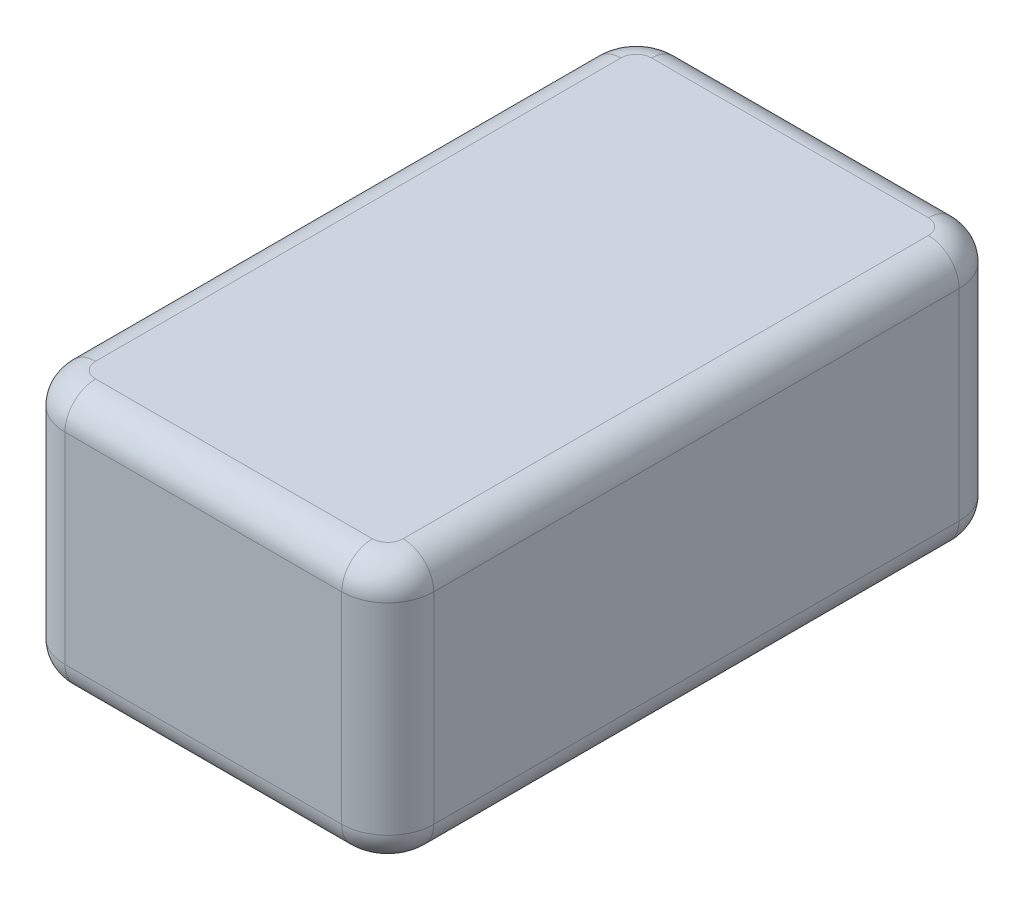
ISO-10303-21;
HEADER;
FILE_DESCRIPTION(('STEP AP214'),'2;1');
FILE_NAME('part.step','',(''),(''),'','','');
FILE_SCHEMA(('AUTOMOTIVE_DESIGN { 1 0 10303 214 1 1 1 1 }'));
ENDSEC;
DATA;
#1=APPLICATION_CONTEXT('core data for automotive mechanical design processes');
#2=APPLICATION_PROTOCOL_DEFINITION('international standard','automotive_design',2000,#1);
#3=PRODUCT_CONTEXT('',#1,'mechanical');
#4=PRODUCT('Part','Part','',(#3));
#5=PRODUCT_RELATED_PRODUCT_CATEGORY('part','',(#4));
#6=PRODUCT_DEFINITION_FORMATION('','',#4);
#7=PRODUCT_DEFINITION_CONTEXT('part definition',#1,'design');
#8=PRODUCT_DEFINITION('design','',#6,#7);
#9=PRODUCT_DEFINITION_SHAPE('','',#8);
#10=(LENGTH_UNIT() NAMED_UNIT(*) SI_UNIT(.MILLI.,.METRE.));
#11=(NAMED_UNIT(*) PLANE_ANGLE_UNIT() SI_UNIT($,.RADIAN.));
#12=(NAMED_UNIT(*) SI_UNIT($,.STERADIAN.) SOLID_ANGLE_UNIT());
#13=UNCERTAINTY_MEASURE_WITH_UNIT(LENGTH_MEASURE(1.E-05),#10,'distance_accuracy_value','');
#14=(GEOMETRIC_REPRESENTATION_CONTEXT(3) GLOBAL_UNCERTAINTY_ASSIGNED_CONTEXT((#13)) GLOBAL_UNIT_ASSIGNED_CONTEXT((#10,
#11,#12)) REPRESENTATION_CONTEXT('',''));
#15=CARTESIAN_POINT('',(0.,0.,0.));
#16=DIRECTION('',(0.,0.,1.));
#17=DIRECTION('',(1.,0.,0.));
#18=AXIS2_PLACEMENT_3D('',#15,#16,#17);
#19=CARTESIAN_POINT('',(0.,217.424,0.));
#20=DIRECTION('',(1.,0.,0.));
#21=DIRECTION('',(0.,0.,-1.));
#22=AXIS2_PLACEMENT_3D('',#19,#20,#21);
#23=PLANE('',#22);
#24=DIRECTION('',(0.,-1.,0.));
#25=VECTOR('',#24,1.);
#26=CARTESIAN_POINT('',(0.,217.424,-472.948));
#27=LINE('',#26,#25);
#28=CARTESIAN_POINT('',(0.,192.024,-472.948));
#29=VERTEX_POINT('',#28);
#30=CARTESIAN_POINT('',(0.,25.4,-472.948));
#31=VERTEX_POINT('',#30);
#32=EDGE_CURVE('E297',#29,#31,#27,.T.);
#33=ORIENTED_EDGE('',*,*,#32,.T.);
#34=DIRECTION('',(0.,0.,1.));
#35=VECTOR('',#34,1.);
#36=CARTESIAN_POINT('',(0.,25.4,-38.1));
#37=LINE('',#36,#35);
#38=CARTESIAN_POINT('',(0.,25.4,-38.1));
#39=VERTEX_POINT('',#38);
#40=EDGE_CURVE('E218',#31,#39,#37,.T.);
#41=ORIENTED_EDGE('',*,*,#40,.T.);
#42=DIRECTION('',(0.,-1.,0.));
#43=VECTOR('',#42,1.);
#44=CARTESIAN_POINT('',(0.,217.424,-38.1));
#45=LINE('',#44,#43);
#46=CARTESIAN_POINT('',(0.,192.024,-38.1));
#47=VERTEX_POINT('',#46);
#48=EDGE_CURVE('E290',#39,#47,#45,.F.);
#49=ORIENTED_EDGE('',*,*,#48,.T.);
#50=DIRECTION('',(0.,0.,1.));
#51=VECTOR('',#50,1.);
#52=CARTESIAN_POINT('',(0.,192.024,0.));
#53=LINE('',#52,#51);
#54=EDGE_CURVE('E216',#47,#29,#53,.F.);
#55=ORIENTED_EDGE('',*,*,#54,.T.);
#56=EDGE_LOOP('',(#33,#41,#49,#55));
#57=FACE_BOUND('',#56,.T.);
#58=ADVANCED_FACE('F37',(#57),#23,.F.);
#59=CARTESIAN_POINT('',(0.,217.424,0.));
#60=DIRECTION('',(0.,0.,-1.));
#61=DIRECTION('',(-1.,0.,0.));
#62=AXIS2_PLACEMENT_3D('',#59,#60,#61);
#63=PLANE('',#62);
#64=DIRECTION('',(0.,-1.,0.));
#65=VECTOR('',#64,1.);
#66=CARTESIAN_POINT('',(38.1,217.424,0.));
#67=LINE('',#66,#65);
#68=CARTESIAN_POINT('',(38.1,192.024,0.));
#69=VERTEX_POINT('',#68);
#70=CARTESIAN_POINT('',(38.1,25.4,0.));
#71=VERTEX_POINT('',#70);
#72=EDGE_CURVE('E179',#69,#71,#67,.T.);
#73=ORIENTED_EDGE('',*,*,#72,.T.);
#74=DIRECTION('',(1.,0.,0.));
#75=VECTOR('',#74,1.);
#76=CARTESIAN_POINT('',(267.208,25.4,0.));
#77=LINE('',#76,#75);
#78=CARTESIAN_POINT('',(267.208,25.4,0.));
#79=VERTEX_POINT('',#78);
#80=EDGE_CURVE('E210',#71,#79,#77,.T.);
#81=ORIENTED_EDGE('',*,*,#80,.T.);
#82=DIRECTION('',(0.,-1.,0.));
#83=VECTOR('',#82,1.);
#84=CARTESIAN_POINT('',(267.208,217.424,0.));
#85=LINE('',#84,#83);
#86=CARTESIAN_POINT('',(267.208,192.024,0.));
#87=VERTEX_POINT('',#86);
#88=EDGE_CURVE('E176',#79,#87,#85,.F.);
#89=ORIENTED_EDGE('',*,*,#88,.T.);
#90=DIRECTION('',(1.,0.,0.));
#91=VECTOR('',#90,1.);
#92=CARTESIAN_POINT('',(0.,192.024,0.));
#93=LINE('',#92,#91);
#94=EDGE_CURVE('E208',#87,#69,#93,.F.);
#95=ORIENTED_EDGE('',*,*,#94,.T.);
#96=EDGE_LOOP('',(#73,#81,#89,#95));
#97=FACE_BOUND('',#96,.T.);
#98=ADVANCED_FACE('F307',(#97),#63,.F.);
#99=CARTESIAN_POINT('',(305.308,217.424,0.));
#100=DIRECTION('',(-1.,0.,0.));
#101=DIRECTION('',(0.,0.,1.));
#102=AXIS2_PLACEMENT_3D('',#99,#100,#101);
#103=PLANE('',#102);
#104=DIRECTION('',(0.,-1.,0.));
#105=VECTOR('',#104,1.);
#106=CARTESIAN_POINT('',(305.308,217.424,-38.1));
#107=LINE('',#106,#105);
#108=CARTESIAN_POINT('',(305.308,192.024,-38.1));
#109=VERTEX_POINT('',#108);
#110=CARTESIAN_POINT('',(305.308,25.4,-38.1));
#111=VERTEX_POINT('',#110);
#112=EDGE_CURVE('E302',#109,#111,#107,.T.);
#113=ORIENTED_EDGE('',*,*,#112,.T.);
#114=DIRECTION('',(0.,0.,-1.));
#115=VECTOR('',#114,1.);
#116=CARTESIAN_POINT('',(305.308,25.4,-472.948));
#117=LINE('',#116,#115);
#118=CARTESIAN_POINT('',(305.308,25.4,-472.948));
#119=VERTEX_POINT('',#118);
#120=EDGE_CURVE('E202',#111,#119,#117,.T.);
#121=ORIENTED_EDGE('',*,*,#120,.T.);
#122=DIRECTION('',(0.,-1.,0.));
#123=VECTOR('',#122,1.);
#124=CARTESIAN_POINT('',(305.308,217.424,-472.948));
#125=LINE('',#124,#123);
#126=CARTESIAN_POINT('',(305.308,192.024,-472.948));
#127=VERTEX_POINT('',#126);
#128=EDGE_CURVE('E298',#119,#127,#125,.F.);
#129=ORIENTED_EDGE('',*,*,#128,.T.);
#130=DIRECTION('',(0.,0.,-1.));
#131=VECTOR('',#130,1.);
#132=CARTESIAN_POINT('',(305.308,192.024,0.));
#133=LINE('',#132,#131);
#134=EDGE_CURVE('E200',#127,#109,#133,.F.);
#135=ORIENTED_EDGE('',*,*,#134,.T.);
#136=EDGE_LOOP('',(#113,#121,#129,#135));
#137=FACE_BOUND('',#136,.T.);
#138=ADVANCED_FACE('F330',(#137),#103,.F.);
#139=CARTESIAN_POINT('',(0.,217.424,-511.048));
#140=DIRECTION('',(0.,0.,1.));
#141=DIRECTION('',(1.,0.,0.));
#142=AXIS2_PLACEMENT_3D('',#139,#140,#141);
#143=PLANE('',#142);
#144=DIRECTION('',(0.,-1.,0.));
#145=VECTOR('',#144,1.);
#146=CARTESIAN_POINT('',(267.208,217.424,-511.048));
#147=LINE('',#146,#145);
#148=CARTESIAN_POINT('',(267.208,192.024,-511.048));
#149=VERTEX_POINT('',#148);
#150=CARTESIAN_POINT('',(267.208,25.4,-511.048));
#151=VERTEX_POINT('',#150);
#152=EDGE_CURVE('E333',#149,#151,#147,.T.);
#153=ORIENTED_EDGE('',*,*,#152,.T.);
#154=DIRECTION('',(-1.,0.,0.));
#155=VECTOR('',#154,1.);
#156=CARTESIAN_POINT('',(38.1,25.4,-511.048));
#157=LINE('',#156,#155);
#158=CARTESIAN_POINT('',(38.1,25.4,-511.048));
#159=VERTEX_POINT('',#158);
#160=EDGE_CURVE('E11',#151,#159,#157,.T.);
#161=ORIENTED_EDGE('',*,*,#160,.T.);
#162=DIRECTION('',(0.,-1.,0.));
#163=VECTOR('',#162,1.);
#164=CARTESIAN_POINT('',(38.1,217.424,-511.048));
#165=LINE('',#164,#163);
#166=CARTESIAN_POINT('',(38.1,192.024,-511.048));
#167=VERTEX_POINT('',#166);
#168=EDGE_CURVE('E253',#159,#167,#165,.F.);
#169=ORIENTED_EDGE('',*,*,#168,.T.);
#170=DIRECTION('',(-1.,0.,0.));
#171=VECTOR('',#170,1.);
#172=CARTESIAN_POINT('',(0.,192.024,-511.048));
#173=LINE('',#172,#171);
#174=EDGE_CURVE('E46',#167,#149,#173,.F.);
#175=ORIENTED_EDGE('',*,*,#174,.T.);
#176=EDGE_LOOP('',(#153,#161,#169,#175));
#177=FACE_BOUND('',#176,.T.);
#178=ADVANCED_FACE('F341',(#177),#143,.F.);
#179=CARTESIAN_POINT('',(0.,217.424,0.));
#180=DIRECTION('',(0.,-1.,0.));
#181=DIRECTION('',(0.,0.,-1.));
#182=AXIS2_PLACEMENT_3D('',#179,#180,#181);
#183=PLANE('',#182);
#184=DIRECTION('',(0.,0.,-1.));
#185=VECTOR('',#184,1.);
#186=CARTESIAN_POINT('',(279.908,217.424,0.));
#187=LINE('',#186,#185);
#188=CARTESIAN_POINT('',(279.908,217.424,-38.1));
#189=VERTEX_POINT('',#188);
#190=CARTESIAN_POINT('',(279.908,217.424,-472.948));
#191=VERTEX_POINT('',#190);
#192=EDGE_CURVE('E54',#189,#191,#187,.T.);
#193=ORIENTED_EDGE('',*,*,#192,.T.);
#194=CARTESIAN_POINT('',(267.208,217.424,-472.948));
#195=DIRECTION('',(0.,-1.,0.));
#196=DIRECTION('',(0.,0.,-1.));
#197=AXIS2_PLACEMENT_3D('',#194,#195,#196);
#198=CIRCLE('',#197,12.7);
#199=CARTESIAN_POINT('',(267.208,217.424,-485.648));
#200=VERTEX_POINT('',#199);
#201=EDGE_CURVE('E235',#191,#200,#198,.F.);
#202=ORIENTED_EDGE('',*,*,#201,.T.);
#203=DIRECTION('',(-1.,0.,0.));
#204=VECTOR('',#203,1.);
#205=CARTESIAN_POINT('',(0.,217.424,-485.648));
#206=LINE('',#205,#204);
#207=CARTESIAN_POINT('',(38.1,217.424,-485.648));
#208=VERTEX_POINT('',#207);
#209=EDGE_CURVE('E223',#200,#208,#206,.T.);
#210=ORIENTED_EDGE('',*,*,#209,.T.);
#211=CARTESIAN_POINT('',(38.1,217.424,-472.948));
#212=DIRECTION('',(0.,-1.,0.));
#213=DIRECTION('',(0.,0.,-1.));
#214=AXIS2_PLACEMENT_3D('',#211,#212,#213);
#215=CIRCLE('',#214,12.7);
#216=CARTESIAN_POINT('',(25.4,217.424,-472.948));
#217=VERTEX_POINT('',#216);
#218=EDGE_CURVE('E225',#208,#217,#215,.F.);
#219=ORIENTED_EDGE('',*,*,#218,.T.);
#220=DIRECTION('',(0.,0.,1.));
#221=VECTOR('',#220,1.);
#222=CARTESIAN_POINT('',(25.4,217.424,0.));
#223=LINE('',#222,#221);
#224=CARTESIAN_POINT('',(25.4,217.424,-38.1));
#225=VERTEX_POINT('',#224);
#226=EDGE_CURVE('E227',#217,#225,#223,.T.);
#227=ORIENTED_EDGE('',*,*,#226,.T.);
#228=CARTESIAN_POINT('',(38.1,217.424,-38.1));
#229=DIRECTION('',(0.,-1.,0.));
#230=DIRECTION('',(0.,0.,-1.));
#231=AXIS2_PLACEMENT_3D('',#228,#229,#230);
#232=CIRCLE('',#231,12.7);
#233=CARTESIAN_POINT('',(38.1,217.424,-25.4));
#234=VERTEX_POINT('',#233);
#235=EDGE_CURVE('E229',#225,#234,#232,.F.);
#236=ORIENTED_EDGE('',*,*,#235,.T.);
#237=DIRECTION('',(1.,0.,0.));
#238=VECTOR('',#237,1.);
#239=CARTESIAN_POINT('',(0.,217.424,-25.4));
#240=LINE('',#239,#238);
#241=CARTESIAN_POINT('',(267.208,217.424,-25.4));
#242=VERTEX_POINT('',#241);
#243=EDGE_CURVE('E231',#234,#242,#240,.T.);
#244=ORIENTED_EDGE('',*,*,#243,.T.);
#245=CARTESIAN_POINT('',(267.208,217.424,-38.1));
#246=DIRECTION('',(0.,-1.,0.));
#247=DIRECTION('',(0.,0.,-1.));
#248=AXIS2_PLACEMENT_3D('',#245,#246,#247);
#249=CIRCLE('',#248,12.7);
#250=EDGE_CURVE('E59',#242,#189,#249,.F.);
#251=ORIENTED_EDGE('',*,*,#250,.T.);
#252=EDGE_LOOP('',(#193,#202,#210,#219,#227,#236,#244,#251));
#253=FACE_BOUND('',#252,.T.);
#254=ADVANCED_FACE('F556',(#253),#183,.F.);
#255=CARTESIAN_POINT('',(0.,0.,0.));
#256=DIRECTION('',(0.,-1.,0.));
#257=DIRECTION('',(0.,0.,-1.));
#258=AXIS2_PLACEMENT_3D('',#255,#256,#257);
#259=PLANE('',#258);
#260=DIRECTION('',(-1.,0.,0.));
#261=VECTOR('',#260,1.);
#262=CARTESIAN_POINT('',(267.208,0.,-485.648));
#263=LINE('',#262,#261);
#264=CARTESIAN_POINT('',(38.1,0.,-485.648));
#265=VERTEX_POINT('',#264);
#266=CARTESIAN_POINT('',(267.208,0.,-485.648));
#267=VERTEX_POINT('',#266);
#268=EDGE_CURVE('E155',#265,#267,#263,.F.);
#269=ORIENTED_EDGE('',*,*,#268,.T.);
#270=CARTESIAN_POINT('',(267.208,0.,-472.948));
#271=DIRECTION('',(0.,-1.,0.));
#272=DIRECTION('',(0.,0.,-1.));
#273=AXIS2_PLACEMENT_3D('',#270,#271,#272);
#274=CIRCLE('',#273,12.7);
#275=CARTESIAN_POINT('',(279.908,0.,-472.948));
#276=VERTEX_POINT('',#275);
#277=EDGE_CURVE('E192',#267,#276,#274,.T.);
#278=ORIENTED_EDGE('',*,*,#277,.T.);
#279=DIRECTION('',(0.,0.,-1.));
#280=VECTOR('',#279,1.);
#281=CARTESIAN_POINT('',(279.908,0.,-38.1));
#282=LINE('',#281,#280);
#283=CARTESIAN_POINT('',(279.908,0.,-38.1));
#284=VERTEX_POINT('',#283);
#285=EDGE_CURVE('E190',#276,#284,#282,.F.);
#286=ORIENTED_EDGE('',*,*,#285,.T.);
#287=CARTESIAN_POINT('',(267.208,0.,-38.1));
#288=DIRECTION('',(0.,-1.,0.));
#289=DIRECTION('',(0.,0.,-1.));
#290=AXIS2_PLACEMENT_3D('',#287,#288,#289);
#291=CIRCLE('',#290,12.7);
#292=CARTESIAN_POINT('',(267.208,0.,-25.4));
#293=VERTEX_POINT('',#292);
#294=EDGE_CURVE('E188',#284,#293,#291,.T.);
#295=ORIENTED_EDGE('',*,*,#294,.T.);
#296=DIRECTION('',(1.,0.,0.));
#297=VECTOR('',#296,1.);
#298=CARTESIAN_POINT('',(38.1,0.,-25.4));
#299=LINE('',#298,#297);
#300=CARTESIAN_POINT('',(38.1,0.,-25.4));
#301=VERTEX_POINT('',#300);
#302=EDGE_CURVE('E186',#293,#301,#299,.F.);
#303=ORIENTED_EDGE('',*,*,#302,.T.);
#304=CARTESIAN_POINT('',(38.1,0.,-38.1));
#305=DIRECTION('',(0.,-1.,0.));
#306=DIRECTION('',(0.,0.,-1.));
#307=AXIS2_PLACEMENT_3D('',#304,#305,#306);
#308=CIRCLE('',#307,12.7);
#309=CARTESIAN_POINT('',(25.4,0.,-38.1));
#310=VERTEX_POINT('',#309);
#311=EDGE_CURVE('E184',#301,#310,#308,.T.);
#312=ORIENTED_EDGE('',*,*,#311,.T.);
#313=DIRECTION('',(0.,0.,1.));
#314=VECTOR('',#313,1.);
#315=CARTESIAN_POINT('',(25.4,0.,-472.948));
#316=LINE('',#315,#314);
#317=CARTESIAN_POINT('',(25.4,0.,-472.948));
#318=VERTEX_POINT('',#317);
#319=EDGE_CURVE('E158',#310,#318,#316,.F.);
#320=ORIENTED_EDGE('',*,*,#319,.T.);
#321=CARTESIAN_POINT('',(38.1,0.,-472.948));
#322=DIRECTION('',(0.,-1.,0.));
#323=DIRECTION('',(0.,0.,-1.));
#324=AXIS2_PLACEMENT_3D('',#321,#322,#323);
#325=CIRCLE('',#324,12.7);
#326=EDGE_CURVE('E150',#318,#265,#325,.T.);
#327=ORIENTED_EDGE('',*,*,#326,.T.);
#328=EDGE_LOOP('',(#269,#278,#286,#295,#303,#312,#320,#327));
#329=FACE_BOUND('',#328,.T.);
#330=ADVANCED_FACE('F152',(#329),#259,.T.);
#331=CARTESIAN_POINT('',(267.208,217.424,-472.948));
#332=DIRECTION('',(0.,-1.,0.));
#333=DIRECTION('',(0.,0.,-1.));
#334=AXIS2_PLACEMENT_3D('',#331,#332,#333);
#335=CYLINDRICAL_SURFACE('',#334,38.1);
#336=ORIENTED_EDGE('',*,*,#128,.F.);
#337=CARTESIAN_POINT('',(267.208,25.4,-472.948));
#338=DIRECTION('',(0.,-1.,0.));
#339=DIRECTION('',(0.,0.,-1.));
#340=AXIS2_PLACEMENT_3D('',#337,#338,#339);
#341=CIRCLE('',#340,38.1);
#342=EDGE_CURVE('E197',#119,#151,#341,.F.);
#343=ORIENTED_EDGE('',*,*,#342,.T.);
#344=ORIENTED_EDGE('',*,*,#152,.F.);
#345=CARTESIAN_POINT('',(267.208,192.024,-472.948));
#346=DIRECTION('',(0.,-1.,0.));
#347=DIRECTION('',(0.,0.,-1.));
#348=AXIS2_PLACEMENT_3D('',#345,#346,#347);
#349=CIRCLE('',#348,38.1);
#350=EDGE_CURVE('E194',#149,#127,#349,.T.);
#351=ORIENTED_EDGE('',*,*,#350,.T.);
#352=EDGE_LOOP('',(#336,#343,#344,#351));
#353=FACE_BOUND('',#352,.T.);
#354=ADVANCED_FACE('F358',(#353),#335,.T.);
#355=CARTESIAN_POINT('',(38.1,217.424,-472.948));
#356=DIRECTION('',(0.,-1.,0.));
#357=DIRECTION('',(0.,0.,-1.));
#358=AXIS2_PLACEMENT_3D('',#355,#356,#357);
#359=CYLINDRICAL_SURFACE('',#358,38.1);
#360=ORIENTED_EDGE('',*,*,#168,.F.);
#361=CARTESIAN_POINT('',(38.1,25.4,-472.948));
#362=DIRECTION('',(0.,-1.,0.));
#363=DIRECTION('',(0.,0.,-1.));
#364=AXIS2_PLACEMENT_3D('',#361,#362,#363);
#365=CIRCLE('',#364,38.1);
#366=EDGE_CURVE('E167',#159,#31,#365,.F.);
#367=ORIENTED_EDGE('',*,*,#366,.T.);
#368=ORIENTED_EDGE('',*,*,#32,.F.);
#369=CARTESIAN_POINT('',(38.1,192.024,-472.948));
#370=DIRECTION('',(0.,-1.,0.));
#371=DIRECTION('',(0.,0.,-1.));
#372=AXIS2_PLACEMENT_3D('',#369,#370,#371);
#373=CIRCLE('',#372,38.1);
#374=EDGE_CURVE('E220',#29,#167,#373,.T.);
#375=ORIENTED_EDGE('',*,*,#374,.T.);
#376=EDGE_LOOP('',(#360,#367,#368,#375));
#377=FACE_BOUND('',#376,.T.);
#378=ADVANCED_FACE('F386',(#377),#359,.T.);
#379=CARTESIAN_POINT('',(267.208,217.424,-38.1));
#380=DIRECTION('',(0.,-1.,0.));
#381=DIRECTION('',(0.,0.,-1.));
#382=AXIS2_PLACEMENT_3D('',#379,#380,#381);
#383=CYLINDRICAL_SURFACE('',#382,38.1);
#384=ORIENTED_EDGE('',*,*,#88,.F.);
#385=CARTESIAN_POINT('',(267.208,25.4,-38.1));
#386=DIRECTION('',(0.,-1.,0.));
#387=DIRECTION('',(0.,0.,-1.));
#388=AXIS2_PLACEMENT_3D('',#385,#386,#387);
#389=CIRCLE('',#388,38.1);
#390=EDGE_CURVE('E206',#79,#111,#389,.F.);
#391=ORIENTED_EDGE('',*,*,#390,.T.);
#392=ORIENTED_EDGE('',*,*,#112,.F.);
#393=CARTESIAN_POINT('',(267.208,192.024,-38.1));
#394=DIRECTION('',(0.,-1.,0.));
#395=DIRECTION('',(0.,0.,-1.));
#396=AXIS2_PLACEMENT_3D('',#393,#394,#395);
#397=CIRCLE('',#396,38.1);
#398=EDGE_CURVE('E204',#109,#87,#397,.T.);
#399=ORIENTED_EDGE('',*,*,#398,.T.);
#400=EDGE_LOOP('',(#384,#391,#392,#399));
#401=FACE_BOUND('',#400,.T.);
#402=ADVANCED_FACE('F327',(#401),#383,.T.);
#403=CARTESIAN_POINT('',(38.1,217.424,-38.1));
#404=DIRECTION('',(0.,-1.,0.));
#405=DIRECTION('',(0.,0.,-1.));
#406=AXIS2_PLACEMENT_3D('',#403,#404,#405);
#407=CYLINDRICAL_SURFACE('',#406,38.1);
#408=ORIENTED_EDGE('',*,*,#48,.F.);
#409=CARTESIAN_POINT('',(38.1,25.4,-38.1));
#410=DIRECTION('',(0.,-1.,0.));
#411=DIRECTION('',(0.,0.,-1.));
#412=AXIS2_PLACEMENT_3D('',#409,#410,#411);
#413=CIRCLE('',#412,38.1);
#414=EDGE_CURVE('E214',#39,#71,#413,.F.);
#415=ORIENTED_EDGE('',*,*,#414,.T.);
#416=ORIENTED_EDGE('',*,*,#72,.F.);
#417=CARTESIAN_POINT('',(38.1,192.024,-38.1));
#418=DIRECTION('',(0.,-1.,0.));
#419=DIRECTION('',(0.,0.,-1.));
#420=AXIS2_PLACEMENT_3D('',#417,#418,#419);
#421=CIRCLE('',#420,38.1);
#422=EDGE_CURVE('E212',#69,#47,#421,.T.);
#423=ORIENTED_EDGE('',*,*,#422,.T.);
#424=EDGE_LOOP('',(#408,#415,#416,#423));
#425=FACE_BOUND('',#424,.T.);
#426=ADVANCED_FACE('F289',(#425),#407,.T.);
#427=CARTESIAN_POINT('',(38.1,25.4,-38.1));
#428=DIRECTION('',(0.,-1.,0.));
#429=DIRECTION('',(0.,0.,-1.));
#430=AXIS2_PLACEMENT_3D('',#427,#428,#429);
#431=DEGENERATE_TOROIDAL_SURFACE('',#430,12.7,25.4,.T.);
#432=CARTESIAN_POINT('',(38.1,25.4,-25.4));
#433=DIRECTION('',(1.,0.,0.));
#434=DIRECTION('',(0.,0.,-1.));
#435=AXIS2_PLACEMENT_3D('',#432,#433,#434);
#436=CIRCLE('',#435,25.4);
#437=EDGE_CURVE('E247',#71,#301,#436,.T.);
#438=ORIENTED_EDGE('',*,*,#437,.F.);
#439=ORIENTED_EDGE('',*,*,#414,.F.);
#440=CARTESIAN_POINT('',(25.4,25.4,-38.1));
#441=DIRECTION('',(0.,0.,-1.));
#442=DIRECTION('',(-1.,0.,0.));
#443=AXIS2_PLACEMENT_3D('',#440,#441,#442);
#444=CIRCLE('',#443,25.4);
#445=EDGE_CURVE('E250',#310,#39,#444,.T.);
#446=ORIENTED_EDGE('',*,*,#445,.F.);
#447=ORIENTED_EDGE('',*,*,#311,.F.);
#448=EDGE_LOOP('',(#438,#439,#446,#447));
#449=FACE_BOUND('',#448,.T.);
#450=ADVANCED_FACE('F312',(#449),#431,.T.);
#451=CARTESIAN_POINT('',(25.4,25.4,0.));
#452=DIRECTION('',(0.,0.,-1.));
#453=DIRECTION('',(-1.,0.,0.));
#454=AXIS2_PLACEMENT_3D('',#451,#452,#453);
#455=CYLINDRICAL_SURFACE('',#454,25.4);
#456=ORIENTED_EDGE('',*,*,#445,.T.);
#457=ORIENTED_EDGE('',*,*,#40,.F.);
#458=CARTESIAN_POINT('',(25.4,25.4,-472.948));
#459=DIRECTION('',(0.,0.,-1.));
#460=DIRECTION('',(-1.,0.,0.));
#461=AXIS2_PLACEMENT_3D('',#458,#459,#460);
#462=CIRCLE('',#461,25.4);
#463=EDGE_CURVE('E245',#318,#31,#462,.T.);
#464=ORIENTED_EDGE('',*,*,#463,.F.);
#465=ORIENTED_EDGE('',*,*,#319,.F.);
#466=EDGE_LOOP('',(#456,#457,#464,#465));
#467=FACE_BOUND('',#466,.T.);
#468=ADVANCED_FACE('F367',(#467),#455,.T.);
#469=CARTESIAN_POINT('',(0.,25.4,-25.4));
#470=DIRECTION('',(-1.,0.,0.));
#471=DIRECTION('',(0.,0.,1.));
#472=AXIS2_PLACEMENT_3D('',#469,#470,#471);
#473=CYLINDRICAL_SURFACE('',#472,25.4);
#474=ORIENTED_EDGE('',*,*,#437,.T.);
#475=ORIENTED_EDGE('',*,*,#302,.F.);
#476=CARTESIAN_POINT('',(267.208,25.4,-25.4));
#477=DIRECTION('',(1.,0.,0.));
#478=DIRECTION('',(0.,0.,-1.));
#479=AXIS2_PLACEMENT_3D('',#476,#477,#478);
#480=CIRCLE('',#479,25.4);
#481=EDGE_CURVE('E170',#79,#293,#480,.T.);
#482=ORIENTED_EDGE('',*,*,#481,.F.);
#483=ORIENTED_EDGE('',*,*,#80,.F.);
#484=EDGE_LOOP('',(#474,#475,#482,#483));
#485=FACE_BOUND('',#484,.T.);
#486=ADVANCED_FACE('F317',(#485),#473,.T.);
#487=CARTESIAN_POINT('',(38.1,25.4,-472.948));
#488=DIRECTION('',(0.,-1.,0.));
#489=DIRECTION('',(0.,0.,-1.));
#490=AXIS2_PLACEMENT_3D('',#487,#488,#489);
#491=DEGENERATE_TOROIDAL_SURFACE('',#490,12.7,25.4,.T.);
#492=ORIENTED_EDGE('',*,*,#463,.T.);
#493=ORIENTED_EDGE('',*,*,#366,.F.);
#494=CARTESIAN_POINT('',(38.1,25.4,-485.648));
#495=DIRECTION('',(1.,0.,0.));
#496=DIRECTION('',(0.,0.,-1.));
#497=AXIS2_PLACEMENT_3D('',#494,#495,#496);
#498=CIRCLE('',#497,25.4);
#499=EDGE_CURVE('E165',#265,#159,#498,.T.);
#500=ORIENTED_EDGE('',*,*,#499,.F.);
#501=ORIENTED_EDGE('',*,*,#326,.F.);
#502=EDGE_LOOP('',(#492,#493,#500,#501));
#503=FACE_BOUND('',#502,.T.);
#504=ADVANCED_FACE('F166',(#503),#491,.T.);
#505=CARTESIAN_POINT('',(267.208,25.4,-38.1));
#506=DIRECTION('',(0.,-1.,0.));
#507=DIRECTION('',(0.,0.,-1.));
#508=AXIS2_PLACEMENT_3D('',#505,#506,#507);
#509=DEGENERATE_TOROIDAL_SURFACE('',#508,12.7,25.4,.T.);
#510=ORIENTED_EDGE('',*,*,#481,.T.);
#511=ORIENTED_EDGE('',*,*,#294,.F.);
#512=CARTESIAN_POINT('',(279.908,25.4,-38.1));
#513=DIRECTION('',(0.,0.,-1.));
#514=DIRECTION('',(-1.,0.,0.));
#515=AXIS2_PLACEMENT_3D('',#512,#513,#514);
#516=CIRCLE('',#515,25.4);
#517=EDGE_CURVE('E171',#111,#284,#516,.T.);
#518=ORIENTED_EDGE('',*,*,#517,.F.);
#519=ORIENTED_EDGE('',*,*,#390,.F.);
#520=EDGE_LOOP('',(#510,#511,#518,#519));
#521=FACE_BOUND('',#520,.T.);
#522=ADVANCED_FACE('F322',(#521),#509,.T.);
#523=CARTESIAN_POINT('',(0.,25.4,-485.648));
#524=DIRECTION('',(1.,0.,0.));
#525=DIRECTION('',(0.,0.,-1.));
#526=AXIS2_PLACEMENT_3D('',#523,#524,#525);
#527=CYLINDRICAL_SURFACE('',#526,25.4);
#528=ORIENTED_EDGE('',*,*,#499,.T.);
#529=ORIENTED_EDGE('',*,*,#160,.F.);
#530=CARTESIAN_POINT('',(267.208,25.4,-485.648));
#531=DIRECTION('',(1.,0.,0.));
#532=DIRECTION('',(0.,0.,-1.));
#533=AXIS2_PLACEMENT_3D('',#530,#531,#532);
#534=CIRCLE('',#533,25.4);
#535=EDGE_CURVE('E174',#267,#151,#534,.T.);
#536=ORIENTED_EDGE('',*,*,#535,.F.);
#537=ORIENTED_EDGE('',*,*,#268,.F.);
#538=EDGE_LOOP('',(#528,#529,#536,#537));
#539=FACE_BOUND('',#538,.T.);
#540=ADVANCED_FACE('F173',(#539),#527,.T.);
#541=CARTESIAN_POINT('',(279.908,25.4,0.));
#542=DIRECTION('',(0.,0.,1.));
#543=DIRECTION('',(1.,0.,0.));
#544=AXIS2_PLACEMENT_3D('',#541,#542,#543);
#545=CYLINDRICAL_SURFACE('',#544,25.4);
#546=ORIENTED_EDGE('',*,*,#517,.T.);
#547=ORIENTED_EDGE('',*,*,#285,.F.);
#548=CARTESIAN_POINT('',(279.908,25.4,-472.948));
#549=DIRECTION('',(0.,0.,-1.));
#550=DIRECTION('',(-1.,0.,0.));
#551=AXIS2_PLACEMENT_3D('',#548,#549,#550);
#552=CIRCLE('',#551,25.4);
#553=EDGE_CURVE('E238',#119,#276,#552,.T.);
#554=ORIENTED_EDGE('',*,*,#553,.F.);
#555=ORIENTED_EDGE('',*,*,#120,.F.);
#556=EDGE_LOOP('',(#546,#547,#554,#555));
#557=FACE_BOUND('',#556,.T.);
#558=ADVANCED_FACE('F365',(#557),#545,.T.);
#559=CARTESIAN_POINT('',(267.208,25.4,-472.948));
#560=DIRECTION('',(0.,-1.,0.));
#561=DIRECTION('',(0.,0.,-1.));
#562=AXIS2_PLACEMENT_3D('',#559,#560,#561);
#563=DEGENERATE_TOROIDAL_SURFACE('',#562,12.7,25.4,.T.);
#564=ORIENTED_EDGE('',*,*,#535,.T.);
#565=ORIENTED_EDGE('',*,*,#342,.F.);
#566=ORIENTED_EDGE('',*,*,#553,.T.);
#567=ORIENTED_EDGE('',*,*,#277,.F.);
#568=EDGE_LOOP('',(#564,#565,#566,#567));
#569=FACE_BOUND('',#568,.T.);
#570=ADVANCED_FACE('F362',(#569),#563,.T.);
#571=CARTESIAN_POINT('',(38.1,192.024,-38.1));
#572=DIRECTION('',(0.,-1.,0.));
#573=DIRECTION('',(0.,0.,-1.));
#574=AXIS2_PLACEMENT_3D('',#571,#572,#573);
#575=DEGENERATE_TOROIDAL_SURFACE('',#574,12.7,25.4,.T.);
#576=CARTESIAN_POINT('',(25.4,192.024,-38.1));
#577=DIRECTION('',(0.,0.,-1.));
#578=DIRECTION('',(-1.,0.,0.));
#579=AXIS2_PLACEMENT_3D('',#576,#577,#578);
#580=CIRCLE('',#579,25.4);
#581=EDGE_CURVE('E269',#47,#225,#580,.T.);
#582=ORIENTED_EDGE('',*,*,#581,.F.);
#583=ORIENTED_EDGE('',*,*,#422,.F.);
#584=CARTESIAN_POINT('',(38.1,192.024,-25.4));
#585=DIRECTION('',(1.,0.,0.));
#586=DIRECTION('',(0.,0.,-1.));
#587=AXIS2_PLACEMENT_3D('',#584,#585,#586);
#588=CIRCLE('',#587,25.4);
#589=EDGE_CURVE('E41',#234,#69,#588,.T.);
#590=ORIENTED_EDGE('',*,*,#589,.F.);
#591=ORIENTED_EDGE('',*,*,#235,.F.);
#592=EDGE_LOOP('',(#582,#583,#590,#591));
#593=FACE_BOUND('',#592,.T.);
#594=ADVANCED_FACE('F39',(#593),#575,.T.);
#595=CARTESIAN_POINT('',(0.,192.024,-25.4));
#596=DIRECTION('',(1.,0.,0.));
#597=DIRECTION('',(0.,0.,-1.));
#598=AXIS2_PLACEMENT_3D('',#595,#596,#597);
#599=CYLINDRICAL_SURFACE('',#598,25.4);
#600=ORIENTED_EDGE('',*,*,#589,.T.);
#601=ORIENTED_EDGE('',*,*,#94,.F.);
#602=CARTESIAN_POINT('',(267.208,192.024,-25.4));
#603=DIRECTION('',(1.,0.,0.));
#604=DIRECTION('',(0.,0.,-1.));
#605=AXIS2_PLACEMENT_3D('',#602,#603,#604);
#606=CIRCLE('',#605,25.4);
#607=EDGE_CURVE('E267',#242,#87,#606,.T.);
#608=ORIENTED_EDGE('',*,*,#607,.F.);
#609=ORIENTED_EDGE('',*,*,#243,.F.);
#610=EDGE_LOOP('',(#600,#601,#608,#609));
#611=FACE_BOUND('',#610,.T.);
#612=ADVANCED_FACE('F280',(#611),#599,.T.);
#613=CARTESIAN_POINT('',(25.4,192.024,0.));
#614=DIRECTION('',(0.,0.,1.));
#615=DIRECTION('',(1.,0.,0.));
#616=AXIS2_PLACEMENT_3D('',#613,#614,#615);
#617=CYLINDRICAL_SURFACE('',#616,25.4);
#618=ORIENTED_EDGE('',*,*,#581,.T.);
#619=ORIENTED_EDGE('',*,*,#226,.F.);
#620=CARTESIAN_POINT('',(25.4,192.024,-472.948));
#621=DIRECTION('',(0.,0.,-1.));
#622=DIRECTION('',(-1.,0.,0.));
#623=AXIS2_PLACEMENT_3D('',#620,#621,#622);
#624=CIRCLE('',#623,25.4);
#625=EDGE_CURVE('E264',#29,#217,#624,.T.);
#626=ORIENTED_EDGE('',*,*,#625,.F.);
#627=ORIENTED_EDGE('',*,*,#54,.F.);
#628=EDGE_LOOP('',(#618,#619,#626,#627));
#629=FACE_BOUND('',#628,.T.);
#630=ADVANCED_FACE('F433',(#629),#617,.T.);
#631=CARTESIAN_POINT('',(267.208,192.024,-38.1));
#632=DIRECTION('',(0.,-1.,0.));
#633=DIRECTION('',(0.,0.,-1.));
#634=AXIS2_PLACEMENT_3D('',#631,#632,#633);
#635=DEGENERATE_TOROIDAL_SURFACE('',#634,12.7,25.4,.T.);
#636=ORIENTED_EDGE('',*,*,#607,.T.);
#637=ORIENTED_EDGE('',*,*,#398,.F.);
#638=CARTESIAN_POINT('',(279.908,192.024,-38.1));
#639=DIRECTION('',(0.,0.,-1.));
#640=DIRECTION('',(-1.,0.,0.));
#641=AXIS2_PLACEMENT_3D('',#638,#639,#640);
#642=CIRCLE('',#641,25.4);
#643=EDGE_CURVE('E261',#189,#109,#642,.T.);
#644=ORIENTED_EDGE('',*,*,#643,.F.);
#645=ORIENTED_EDGE('',*,*,#250,.F.);
#646=EDGE_LOOP('',(#636,#637,#644,#645));
#647=FACE_BOUND('',#646,.T.);
#648=ADVANCED_FACE('F439',(#647),#635,.T.);
#649=CARTESIAN_POINT('',(38.1,192.024,-472.948));
#650=DIRECTION('',(0.,-1.,0.));
#651=DIRECTION('',(0.,0.,-1.));
#652=AXIS2_PLACEMENT_3D('',#649,#650,#651);
#653=DEGENERATE_TOROIDAL_SURFACE('',#652,12.7,25.4,.T.);
#654=ORIENTED_EDGE('',*,*,#625,.T.);
#655=ORIENTED_EDGE('',*,*,#218,.F.);
#656=CARTESIAN_POINT('',(38.1,192.024,-485.648));
#657=DIRECTION('',(1.,0.,0.));
#658=DIRECTION('',(0.,0.,-1.));
#659=AXIS2_PLACEMENT_3D('',#656,#657,#658);
#660=CIRCLE('',#659,25.4);
#661=EDGE_CURVE('E258',#167,#208,#660,.T.);
#662=ORIENTED_EDGE('',*,*,#661,.F.);
#663=ORIENTED_EDGE('',*,*,#374,.F.);
#664=EDGE_LOOP('',(#654,#655,#662,#663));
#665=FACE_BOUND('',#664,.T.);
#666=ADVANCED_FACE('F348',(#665),#653,.T.);
#667=CARTESIAN_POINT('',(279.908,192.024,0.));
#668=DIRECTION('',(0.,0.,-1.));
#669=DIRECTION('',(-1.,0.,0.));
#670=AXIS2_PLACEMENT_3D('',#667,#668,#669);
#671=CYLINDRICAL_SURFACE('',#670,25.4);
#672=ORIENTED_EDGE('',*,*,#643,.T.);
#673=ORIENTED_EDGE('',*,*,#134,.F.);
#674=CARTESIAN_POINT('',(279.908,192.024,-472.948));
#675=DIRECTION('',(0.,0.,-1.));
#676=DIRECTION('',(-1.,0.,0.));
#677=AXIS2_PLACEMENT_3D('',#674,#675,#676);
#678=CIRCLE('',#677,25.4);
#679=EDGE_CURVE('E256',#191,#127,#678,.T.);
#680=ORIENTED_EDGE('',*,*,#679,.F.);
#681=ORIENTED_EDGE('',*,*,#192,.F.);
#682=EDGE_LOOP('',(#672,#673,#680,#681));
#683=FACE_BOUND('',#682,.T.);
#684=ADVANCED_FACE('F453',(#683),#671,.T.);
#685=CARTESIAN_POINT('',(0.,192.024,-485.648));
#686=DIRECTION('',(-1.,0.,0.));
#687=DIRECTION('',(0.,0.,1.));
#688=AXIS2_PLACEMENT_3D('',#685,#686,#687);
#689=CYLINDRICAL_SURFACE('',#688,25.4);
#690=ORIENTED_EDGE('',*,*,#661,.T.);
#691=ORIENTED_EDGE('',*,*,#209,.F.);
#692=CARTESIAN_POINT('',(267.208,192.024,-485.648));
#693=DIRECTION('',(1.,0.,0.));
#694=DIRECTION('',(0.,0.,-1.));
#695=AXIS2_PLACEMENT_3D('',#692,#693,#694);
#696=CIRCLE('',#695,25.4);
#697=EDGE_CURVE('E254',#149,#200,#696,.T.);
#698=ORIENTED_EDGE('',*,*,#697,.F.);
#699=ORIENTED_EDGE('',*,*,#174,.F.);
#700=EDGE_LOOP('',(#690,#691,#698,#699));
#701=FACE_BOUND('',#700,.T.);
#702=ADVANCED_FACE('F352',(#701),#689,.T.);
#703=CARTESIAN_POINT('',(267.208,192.024,-472.948));
#704=DIRECTION('',(0.,-1.,0.));
#705=DIRECTION('',(0.,0.,-1.));
#706=AXIS2_PLACEMENT_3D('',#703,#704,#705);
#707=DEGENERATE_TOROIDAL_SURFACE('',#706,12.7,25.4,.T.);
#708=ORIENTED_EDGE('',*,*,#679,.T.);
#709=ORIENTED_EDGE('',*,*,#350,.F.);
#710=ORIENTED_EDGE('',*,*,#697,.T.);
#711=ORIENTED_EDGE('',*,*,#201,.F.);
#712=EDGE_LOOP('',(#708,#709,#710,#711));
#713=FACE_BOUND('',#712,.T.);
#714=ADVANCED_FACE('F356',(#713),#707,.T.);
#715=CLOSED_SHELL('',(#58,#98,#138,#178,#254,#330,#354,#378,#402,#426,#450,#468,#486,#504,#522,
#540,#558,#570,#594,#612,#630,#648,#666,#684,#702,#714));
#716=MANIFOLD_SOLID_BREP('B2',#715);
#717=ADVANCED_BREP_SHAPE_REPRESENTATION('',(#18,#716),#14);
#718=SHAPE_DEFINITION_REPRESENTATION(#9,#717);
ENDSEC;
END-ISO-10303-21;
